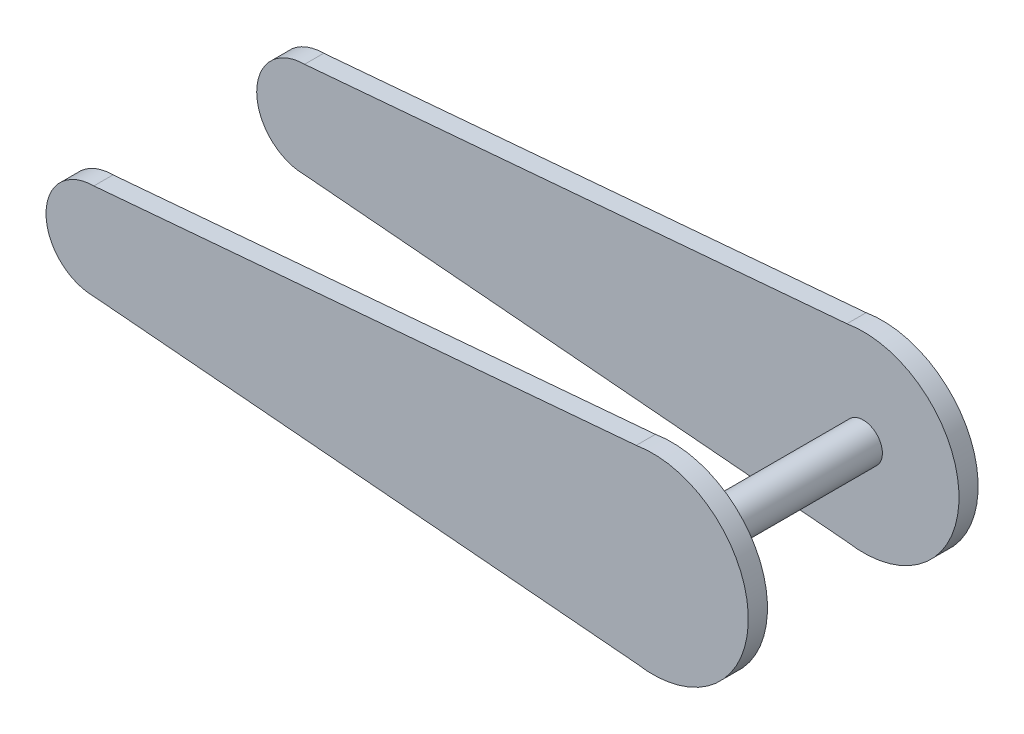
ISO-10303-21;
HEADER;
FILE_DESCRIPTION(('STEP AP214'),'2;1');
FILE_NAME('part.step','',(''),(''),'','','');
FILE_SCHEMA(('AUTOMOTIVE_DESIGN { 1 0 10303 214 1 1 1 1 }'));
ENDSEC;
DATA;
#1=APPLICATION_CONTEXT('core data for automotive mechanical design processes');
#2=APPLICATION_PROTOCOL_DEFINITION('international standard','automotive_design',2000,#1);
#3=PRODUCT_CONTEXT('',#1,'mechanical');
#4=PRODUCT('Part','Part','',(#3));
#5=PRODUCT_RELATED_PRODUCT_CATEGORY('part','',(#4));
#6=PRODUCT_DEFINITION_FORMATION('','',#4);
#7=PRODUCT_DEFINITION_CONTEXT('part definition',#1,'design');
#8=PRODUCT_DEFINITION('design','',#6,#7);
#9=PRODUCT_DEFINITION_SHAPE('','',#8);
#10=(LENGTH_UNIT() NAMED_UNIT(*) SI_UNIT(.MILLI.,.METRE.));
#11=(NAMED_UNIT(*) PLANE_ANGLE_UNIT() SI_UNIT($,.RADIAN.));
#12=(NAMED_UNIT(*) SI_UNIT($,.STERADIAN.) SOLID_ANGLE_UNIT());
#13=UNCERTAINTY_MEASURE_WITH_UNIT(LENGTH_MEASURE(1.E-05),#10,'distance_accuracy_value','');
#14=(GEOMETRIC_REPRESENTATION_CONTEXT(3) GLOBAL_UNCERTAINTY_ASSIGNED_CONTEXT((#13)) GLOBAL_UNIT_ASSIGNED_CONTEXT((#10,
#11,#12)) REPRESENTATION_CONTEXT('',''));
#15=CARTESIAN_POINT('',(0.,0.,0.));
#16=DIRECTION('',(0.,0.,1.));
#17=DIRECTION('',(1.,0.,0.));
#18=AXIS2_PLACEMENT_3D('',#15,#16,#17);
#19=CARTESIAN_POINT('',(0.,0.,18.));
#20=DIRECTION('',(0.,0.,1.));
#21=DIRECTION('',(1.,0.,0.));
#22=AXIS2_PLACEMENT_3D('',#19,#20,#21);
#23=PLANE('',#22);
#24=DIRECTION('',(-0.996346649041751,0.0854011413464357,0.));
#25=VECTOR('',#24,1.);
#26=CARTESIAN_POINT('',(-1.27633711507293,-14.8905996758509,18.));
#27=LINE('',#26,#25);
#28=CARTESIAN_POINT('',(-2.55267423014589,-14.7811993517018,18.));
#29=VERTEX_POINT('',#28);
#30=CARTESIAN_POINT('',(-87.5,-7.50000000000001,18.));
#31=VERTEX_POINT('',#30);
#32=EDGE_CURVE('E155',#29,#31,#27,.T.);
#33=ORIENTED_EDGE('',*,*,#32,.F.);
#34=CARTESIAN_POINT('',(0.,0.,18.));
#35=DIRECTION('',(0.,0.,1.));
#36=DIRECTION('',(1.,0.,0.));
#37=AXIS2_PLACEMENT_3D('',#34,#35,#36);
#38=CIRCLE('',#37,15.);
#39=CARTESIAN_POINT('',(-2.55267423014589,14.7811993517018,18.));
#40=VERTEX_POINT('',#39);
#41=EDGE_CURVE('E160',#29,#40,#38,.T.);
#42=ORIENTED_EDGE('',*,*,#41,.T.);
#43=DIRECTION('',(0.996346649041751,0.0854011413464357,0.));
#44=VECTOR('',#43,1.);
#45=CARTESIAN_POINT('',(-1.27633711507293,14.8905996758509,18.));
#46=LINE('',#45,#44);
#47=CARTESIAN_POINT('',(-87.5,7.50000000000001,18.));
#48=VERTEX_POINT('',#47);
#49=EDGE_CURVE('E157',#48,#40,#46,.T.);
#50=ORIENTED_EDGE('',*,*,#49,.F.);
#51=CARTESIAN_POINT('',(-87.5,0.,18.));
#52=DIRECTION('',(0.,0.,1.));
#53=DIRECTION('',(1.,0.,0.));
#54=AXIS2_PLACEMENT_3D('',#51,#52,#53);
#55=CIRCLE('',#54,7.50000000000001);
#56=EDGE_CURVE('E151',#48,#31,#55,.T.);
#57=ORIENTED_EDGE('',*,*,#56,.T.);
#58=EDGE_LOOP('',(#33,#42,#50,#57));
#59=FACE_BOUND('',#58,.T.);
#60=ADVANCED_FACE('F83',(#59),#23,.T.);
#61=CARTESIAN_POINT('',(0.,0.,-18.));
#62=DIRECTION('',(0.,0.,1.));
#63=DIRECTION('',(1.,0.,0.));
#64=AXIS2_PLACEMENT_3D('',#61,#62,#63);
#65=PLANE('',#64);
#66=CARTESIAN_POINT('',(0.,0.,-18.));
#67=DIRECTION('',(0.,0.,1.));
#68=DIRECTION('',(1.,0.,0.));
#69=AXIS2_PLACEMENT_3D('',#66,#67,#68);
#70=CIRCLE('',#69,15.);
#71=CARTESIAN_POINT('',(-2.55267423014589,-14.7811993517018,-18.));
#72=VERTEX_POINT('',#71);
#73=CARTESIAN_POINT('',(-2.55267423014589,14.7811993517018,-18.));
#74=VERTEX_POINT('',#73);
#75=EDGE_CURVE('E204',#72,#74,#70,.T.);
#76=ORIENTED_EDGE('',*,*,#75,.F.);
#77=DIRECTION('',(-0.996346649041751,0.0854011413464357,0.));
#78=VECTOR('',#77,1.);
#79=CARTESIAN_POINT('',(-1.27633711507293,-14.8905996758509,-18.));
#80=LINE('',#79,#78);
#81=CARTESIAN_POINT('',(-87.5,-7.50000000000001,-18.));
#82=VERTEX_POINT('',#81);
#83=EDGE_CURVE('E178',#72,#82,#80,.T.);
#84=ORIENTED_EDGE('',*,*,#83,.T.);
#85=CARTESIAN_POINT('',(-87.5,0.,-18.));
#86=DIRECTION('',(0.,0.,1.));
#87=DIRECTION('',(1.,0.,0.));
#88=AXIS2_PLACEMENT_3D('',#85,#86,#87);
#89=CIRCLE('',#88,7.50000000000001);
#90=CARTESIAN_POINT('',(-87.5,7.50000000000001,-18.));
#91=VERTEX_POINT('',#90);
#92=EDGE_CURVE('E196',#91,#82,#89,.T.);
#93=ORIENTED_EDGE('',*,*,#92,.F.);
#94=DIRECTION('',(0.996346649041751,0.0854011413464357,0.));
#95=VECTOR('',#94,1.);
#96=CARTESIAN_POINT('',(-1.27633711507293,14.8905996758509,-18.));
#97=LINE('',#96,#95);
#98=EDGE_CURVE('E200',#91,#74,#97,.T.);
#99=ORIENTED_EDGE('',*,*,#98,.T.);
#100=EDGE_LOOP('',(#76,#84,#93,#99));
#101=FACE_BOUND('',#100,.T.);
#102=ADVANCED_FACE('F230',(#101),#65,.F.);
#103=CARTESIAN_POINT('',(15.,0.,15.));
#104=DIRECTION('',(0.,0.,-1.));
#105=DIRECTION('',(0.,1.,0.));
#106=AXIS2_PLACEMENT_3D('',#103,#104,#105);
#107=PLANE('',#106);
#108=CARTESIAN_POINT('',(0.,0.,15.));
#109=DIRECTION('',(0.,0.,-1.));
#110=DIRECTION('',(0.,1.,0.));
#111=AXIS2_PLACEMENT_3D('',#108,#109,#110);
#112=CIRCLE('',#111,3.);
#113=CARTESIAN_POINT('',(0.,3.,15.));
#114=VERTEX_POINT('',#113);
#115=EDGE_CURVE('E206',#114,#114,#112,.T.);
#116=ORIENTED_EDGE('',*,*,#115,.F.);
#117=EDGE_LOOP('',(#116));
#118=FACE_BOUND('',#117,.T.);
#119=CARTESIAN_POINT('',(0.,0.,15.));
#120=DIRECTION('',(0.,0.,-1.));
#121=DIRECTION('',(0.,1.,0.));
#122=AXIS2_PLACEMENT_3D('',#119,#120,#121);
#123=CIRCLE('',#122,15.);
#124=CARTESIAN_POINT('',(-2.55267423014589,14.7811993517018,15.));
#125=VERTEX_POINT('',#124);
#126=CARTESIAN_POINT('',(-2.55267423014589,-14.7811993517018,15.));
#127=VERTEX_POINT('',#126);
#128=EDGE_CURVE('E98',#125,#127,#123,.T.);
#129=ORIENTED_EDGE('',*,*,#128,.T.);
#130=DIRECTION('',(0.996346649041751,-0.0854011413464357,0.));
#131=VECTOR('',#130,1.);
#132=CARTESIAN_POINT('',(13.614262560778,-16.1669367909238,15.));
#133=LINE('',#132,#131);
#134=CARTESIAN_POINT('',(-87.5,-7.50000000000001,15.));
#135=VERTEX_POINT('',#134);
#136=EDGE_CURVE('E176',#135,#127,#133,.T.);
#137=ORIENTED_EDGE('',*,*,#136,.F.);
#138=CARTESIAN_POINT('',(-87.5,0.,15.));
#139=DIRECTION('',(0.,0.,-1.));
#140=DIRECTION('',(0.,1.,0.));
#141=AXIS2_PLACEMENT_3D('',#138,#139,#140);
#142=CIRCLE('',#141,7.50000000000001);
#143=CARTESIAN_POINT('',(-87.5,7.50000000000001,15.));
#144=VERTEX_POINT('',#143);
#145=EDGE_CURVE('E166',#135,#144,#142,.T.);
#146=ORIENTED_EDGE('',*,*,#145,.T.);
#147=DIRECTION('',(-0.996346649041751,-0.0854011413464357,0.));
#148=VECTOR('',#147,1.);
#149=CARTESIAN_POINT('',(13.614262560778,16.1669367909238,15.));
#150=LINE('',#149,#148);
#151=EDGE_CURVE('E198',#125,#144,#150,.T.);
#152=ORIENTED_EDGE('',*,*,#151,.F.);
#153=EDGE_LOOP('',(#129,#137,#146,#152));
#154=FACE_BOUND('',#153,.T.);
#155=ADVANCED_FACE('F232',(#118,#154),#107,.T.);
#156=CARTESIAN_POINT('',(15.,15.,-15.));
#157=DIRECTION('',(0.,0.,-1.));
#158=DIRECTION('',(0.,1.,0.));
#159=AXIS2_PLACEMENT_3D('',#156,#157,#158);
#160=PLANE('',#159);
#161=CARTESIAN_POINT('',(0.,0.,-15.));
#162=DIRECTION('',(0.,0.,-1.));
#163=DIRECTION('',(0.,1.,0.));
#164=AXIS2_PLACEMENT_3D('',#161,#162,#163);
#165=CIRCLE('',#164,3.);
#166=CARTESIAN_POINT('',(0.,3.,-15.));
#167=VERTEX_POINT('',#166);
#168=EDGE_CURVE('E209',#167,#167,#165,.T.);
#169=ORIENTED_EDGE('',*,*,#168,.T.);
#170=EDGE_LOOP('',(#169));
#171=FACE_BOUND('',#170,.T.);
#172=DIRECTION('',(0.996346649041751,-0.0854011413464357,0.));
#173=VECTOR('',#172,1.);
#174=CARTESIAN_POINT('',(12.337925445705,-16.0575364667747,-15.));
#175=LINE('',#174,#173);
#176=CARTESIAN_POINT('',(-87.5,-7.50000000000001,-15.));
#177=VERTEX_POINT('',#176);
#178=CARTESIAN_POINT('',(-2.55267423014589,-14.7811993517018,-15.));
#179=VERTEX_POINT('',#178);
#180=EDGE_CURVE('E12',#177,#179,#175,.T.);
#181=ORIENTED_EDGE('',*,*,#180,.T.);
#182=CARTESIAN_POINT('',(0.,0.,-15.));
#183=DIRECTION('',(0.,0.,-1.));
#184=DIRECTION('',(0.,1.,0.));
#185=AXIS2_PLACEMENT_3D('',#182,#183,#184);
#186=CIRCLE('',#185,15.);
#187=CARTESIAN_POINT('',(-2.55267423014589,14.7811993517018,-15.));
#188=VERTEX_POINT('',#187);
#189=EDGE_CURVE('E91',#188,#179,#186,.T.);
#190=ORIENTED_EDGE('',*,*,#189,.F.);
#191=DIRECTION('',(-0.996346649041751,-0.0854011413464357,0.));
#192=VECTOR('',#191,1.);
#193=CARTESIAN_POINT('',(14.8905996758509,16.2763371150729,-15.));
#194=LINE('',#193,#192);
#195=CARTESIAN_POINT('',(-87.5,7.50000000000001,-15.));
#196=VERTEX_POINT('',#195);
#197=EDGE_CURVE('E106',#188,#196,#194,.T.);
#198=ORIENTED_EDGE('',*,*,#197,.T.);
#199=CARTESIAN_POINT('',(-87.5,0.,-15.));
#200=DIRECTION('',(0.,0.,-1.));
#201=DIRECTION('',(0.,1.,0.));
#202=AXIS2_PLACEMENT_3D('',#199,#200,#201);
#203=CIRCLE('',#202,7.50000000000001);
#204=EDGE_CURVE('E193',#177,#196,#203,.T.);
#205=ORIENTED_EDGE('',*,*,#204,.F.);
#206=EDGE_LOOP('',(#181,#190,#198,#205));
#207=FACE_BOUND('',#206,.T.);
#208=ADVANCED_FACE('F223',(#171,#207),#160,.F.);
#209=CARTESIAN_POINT('',(0.,0.,18.));
#210=DIRECTION('',(0.,0.,-1.));
#211=DIRECTION('',(-1.,0.,0.));
#212=AXIS2_PLACEMENT_3D('',#209,#210,#211);
#213=CYLINDRICAL_SURFACE('',#212,3.);
#214=ORIENTED_EDGE('',*,*,#115,.T.);
#215=EDGE_LOOP('',(#214));
#216=FACE_BOUND('',#215,.T.);
#217=ORIENTED_EDGE('',*,*,#168,.F.);
#218=EDGE_LOOP('',(#217));
#219=FACE_BOUND('',#218,.T.);
#220=ADVANCED_FACE('F85',(#216,#219),#213,.T.);
#221=CARTESIAN_POINT('',(-87.5,0.,-77.));
#222=DIRECTION('',(0.,0.,1.));
#223=DIRECTION('',(1.,0.,0.));
#224=AXIS2_PLACEMENT_3D('',#221,#222,#223);
#225=CYLINDRICAL_SURFACE('',#224,7.50000000000001);
#226=ORIENTED_EDGE('',*,*,#145,.F.);
#227=DIRECTION('',(0.,0.,1.));
#228=VECTOR('',#227,1.);
#229=CARTESIAN_POINT('',(-87.5,-7.50000000000001,-77.));
#230=LINE('',#229,#228);
#231=EDGE_CURVE('E163',#135,#31,#230,.T.);
#232=ORIENTED_EDGE('',*,*,#231,.T.);
#233=ORIENTED_EDGE('',*,*,#56,.F.);
#234=DIRECTION('',(0.,0.,1.));
#235=VECTOR('',#234,1.);
#236=CARTESIAN_POINT('',(-87.5,7.50000000000001,-77.));
#237=LINE('',#236,#235);
#238=EDGE_CURVE('E187',#144,#48,#237,.T.);
#239=ORIENTED_EDGE('',*,*,#238,.F.);
#240=EDGE_LOOP('',(#226,#232,#233,#239));
#241=FACE_BOUND('',#240,.T.);
#242=ADVANCED_FACE('F164',(#241),#225,.T.);
#243=CARTESIAN_POINT('',(0.,0.,-77.));
#244=DIRECTION('',(0.,0.,1.));
#245=DIRECTION('',(1.,0.,0.));
#246=AXIS2_PLACEMENT_3D('',#243,#244,#245);
#247=CYLINDRICAL_SURFACE('',#246,15.);
#248=DIRECTION('',(0.,0.,1.));
#249=VECTOR('',#248,1.);
#250=CARTESIAN_POINT('',(-2.55267423014589,14.7811993517018,-77.));
#251=LINE('',#250,#249);
#252=EDGE_CURVE('E188',#125,#40,#251,.T.);
#253=ORIENTED_EDGE('',*,*,#252,.T.);
#254=ORIENTED_EDGE('',*,*,#41,.F.);
#255=DIRECTION('',(0.,0.,1.));
#256=VECTOR('',#255,1.);
#257=CARTESIAN_POINT('',(-2.55267423014589,-14.7811993517018,-77.));
#258=LINE('',#257,#256);
#259=EDGE_CURVE('E175',#127,#29,#258,.T.);
#260=ORIENTED_EDGE('',*,*,#259,.F.);
#261=ORIENTED_EDGE('',*,*,#128,.F.);
#262=EDGE_LOOP('',(#253,#254,#260,#261));
#263=FACE_BOUND('',#262,.T.);
#264=ADVANCED_FACE('F244',(#263),#247,.T.);
#265=CARTESIAN_POINT('',(-1.27633711507293,14.8905996758509,-77.));
#266=DIRECTION('',(0.0854011413464357,-0.996346649041751,0.));
#267=DIRECTION('',(0.996346649041751,0.0854011413464357,0.));
#268=AXIS2_PLACEMENT_3D('',#265,#266,#267);
#269=PLANE('',#268);
#270=ORIENTED_EDGE('',*,*,#151,.T.);
#271=ORIENTED_EDGE('',*,*,#238,.T.);
#272=ORIENTED_EDGE('',*,*,#49,.T.);
#273=ORIENTED_EDGE('',*,*,#252,.F.);
#274=EDGE_LOOP('',(#270,#271,#272,#273));
#275=FACE_BOUND('',#274,.T.);
#276=ADVANCED_FACE('F247',(#275),#269,.F.);
#277=ORIENTED_EDGE('',*,*,#75,.T.);
#278=EDGE_CURVE('E190',#74,#188,#251,.T.);
#279=ORIENTED_EDGE('',*,*,#278,.T.);
#280=ORIENTED_EDGE('',*,*,#189,.T.);
#281=EDGE_CURVE('E171',#72,#179,#258,.T.);
#282=ORIENTED_EDGE('',*,*,#281,.F.);
#283=EDGE_LOOP('',(#277,#279,#280,#282));
#284=FACE_BOUND('',#283,.T.);
#285=ADVANCED_FACE('F216',(#284),#247,.T.);
#286=EDGE_CURVE('E191',#91,#196,#237,.T.);
#287=ORIENTED_EDGE('',*,*,#286,.T.);
#288=ORIENTED_EDGE('',*,*,#197,.F.);
#289=ORIENTED_EDGE('',*,*,#278,.F.);
#290=ORIENTED_EDGE('',*,*,#98,.F.);
#291=EDGE_LOOP('',(#287,#288,#289,#290));
#292=FACE_BOUND('',#291,.T.);
#293=ADVANCED_FACE('F228',(#292),#269,.F.);
#294=ORIENTED_EDGE('',*,*,#92,.T.);
#295=EDGE_CURVE('E170',#82,#177,#230,.T.);
#296=ORIENTED_EDGE('',*,*,#295,.T.);
#297=ORIENTED_EDGE('',*,*,#204,.T.);
#298=ORIENTED_EDGE('',*,*,#286,.F.);
#299=EDGE_LOOP('',(#294,#296,#297,#298));
#300=FACE_BOUND('',#299,.T.);
#301=ADVANCED_FACE('F226',(#300),#225,.T.);
#302=CARTESIAN_POINT('',(-1.27633711507293,-14.8905996758509,-77.));
#303=DIRECTION('',(0.0854011413464357,0.996346649041751,0.));
#304=DIRECTION('',(-0.996346649041751,0.0854011413464357,0.));
#305=AXIS2_PLACEMENT_3D('',#302,#303,#304);
#306=PLANE('',#305);
#307=ORIENTED_EDGE('',*,*,#281,.T.);
#308=ORIENTED_EDGE('',*,*,#180,.F.);
#309=ORIENTED_EDGE('',*,*,#295,.F.);
#310=ORIENTED_EDGE('',*,*,#83,.F.);
#311=EDGE_LOOP('',(#307,#308,#309,#310));
#312=FACE_BOUND('',#311,.T.);
#313=ADVANCED_FACE('F221',(#312),#306,.F.);
#314=ORIENTED_EDGE('',*,*,#136,.T.);
#315=ORIENTED_EDGE('',*,*,#259,.T.);
#316=ORIENTED_EDGE('',*,*,#32,.T.);
#317=ORIENTED_EDGE('',*,*,#231,.F.);
#318=EDGE_LOOP('',(#314,#315,#316,#317));
#319=FACE_BOUND('',#318,.T.);
#320=ADVANCED_FACE('F174',(#319),#306,.F.);
#321=CLOSED_SHELL('',(#60,#102,#155,#208,#220,#242,#264,#276,#285,#293,#301,#313,#320));
#322=MANIFOLD_SOLID_BREP('B2',#321);
#323=ADVANCED_BREP_SHAPE_REPRESENTATION('',(#18,#322),#14);
#324=SHAPE_DEFINITION_REPRESENTATION(#9,#323);
ENDSEC;
END-ISO-10303-21;
